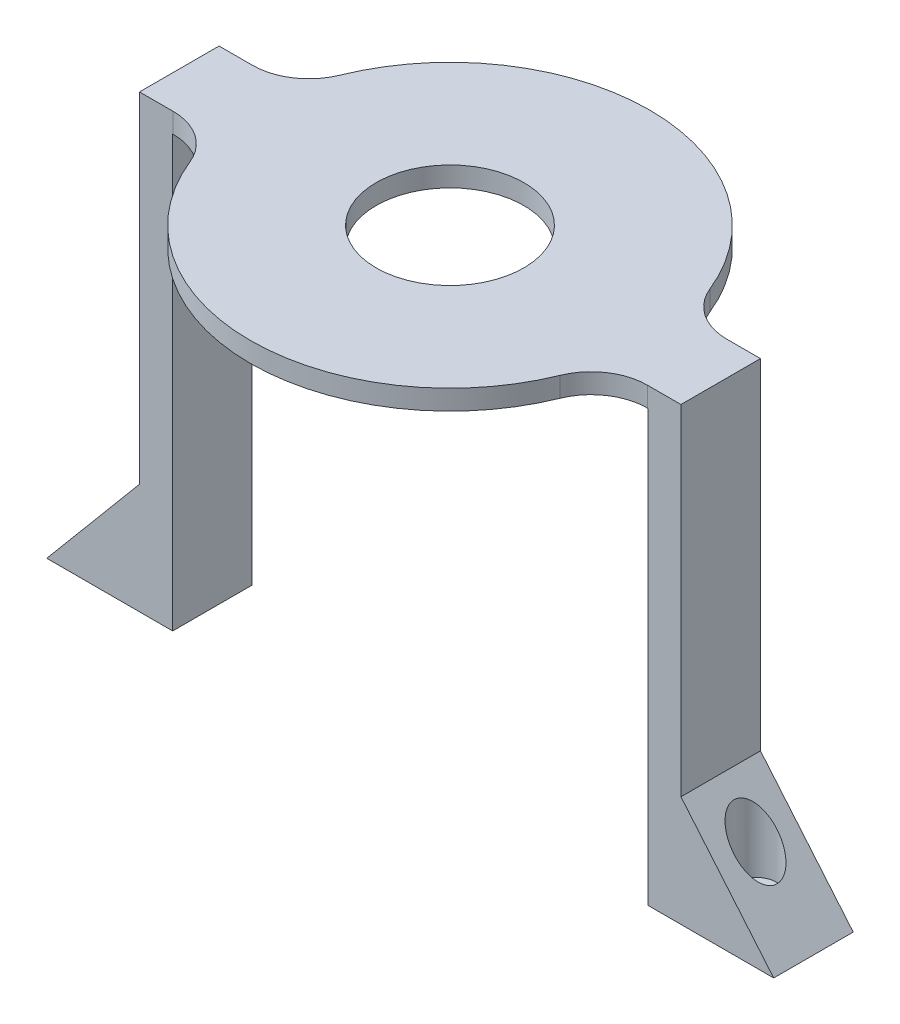
ISO-10303-21;
HEADER;
FILE_DESCRIPTION(('STEP AP214'),'2;1');
FILE_NAME('part.step','',(''),(''),'','','');
FILE_SCHEMA(('AUTOMOTIVE_DESIGN { 1 0 10303 214 1 1 1 1 }'));
ENDSEC;
DATA;
#1=APPLICATION_CONTEXT('core data for automotive mechanical design processes');
#2=APPLICATION_PROTOCOL_DEFINITION('international standard','automotive_design',2000,#1);
#3=PRODUCT_CONTEXT('',#1,'mechanical');
#4=PRODUCT('Part','Part','',(#3));
#5=PRODUCT_RELATED_PRODUCT_CATEGORY('part','',(#4));
#6=PRODUCT_DEFINITION_FORMATION('','',#4);
#7=PRODUCT_DEFINITION_CONTEXT('part definition',#1,'design');
#8=PRODUCT_DEFINITION('design','',#6,#7);
#9=PRODUCT_DEFINITION_SHAPE('','',#8);
#10=(LENGTH_UNIT() NAMED_UNIT(*) SI_UNIT(.MILLI.,.METRE.));
#11=(NAMED_UNIT(*) PLANE_ANGLE_UNIT() SI_UNIT($,.RADIAN.));
#12=(NAMED_UNIT(*) SI_UNIT($,.STERADIAN.) SOLID_ANGLE_UNIT());
#13=UNCERTAINTY_MEASURE_WITH_UNIT(LENGTH_MEASURE(1.E-05),#10,'distance_accuracy_value','');
#14=(GEOMETRIC_REPRESENTATION_CONTEXT(3) GLOBAL_UNCERTAINTY_ASSIGNED_CONTEXT((#13)) GLOBAL_UNIT_ASSIGNED_CONTEXT((#10,
#11,#12)) REPRESENTATION_CONTEXT('',''));
#15=CARTESIAN_POINT('',(0.,0.,0.));
#16=DIRECTION('',(0.,0.,1.));
#17=DIRECTION('',(1.,0.,0.));
#18=AXIS2_PLACEMENT_3D('',#15,#16,#17);
#19=CARTESIAN_POINT('',(0.,3.,0.));
#20=DIRECTION('',(0.,1.,0.));
#21=DIRECTION('',(0.,0.,1.));
#22=AXIS2_PLACEMENT_3D('',#19,#20,#21);
#23=PLANE('',#22);
#24=CARTESIAN_POINT('',(0.,3.,0.));
#25=DIRECTION('',(0.,1.,0.));
#26=DIRECTION('',(0.,0.,1.));
#27=AXIS2_PLACEMENT_3D('',#24,#25,#26);
#28=CIRCLE('',#27,30.125);
#29=CARTESIAN_POINT('',(27.9216896559898,3.,-11.3090614886731));
#30=VERTEX_POINT('',#29);
#31=CARTESIAN_POINT('',(-27.9216896559898,3.,-11.3090614886731));
#32=VERTEX_POINT('',#31);
#33=EDGE_CURVE('E300',#30,#32,#28,.T.);
#34=ORIENTED_EDGE('',*,*,#33,.T.);
#35=CARTESIAN_POINT('',(-35.8000087290492,3.,-14.5));
#36=DIRECTION('',(0.,1.,0.));
#37=DIRECTION('',(0.,0.,1.));
#38=AXIS2_PLACEMENT_3D('',#35,#36,#37);
#39=CIRCLE('',#38,8.5);
#40=CARTESIAN_POINT('',(-35.8000087290492,3.,-6.));
#41=VERTEX_POINT('',#40);
#42=EDGE_CURVE('E387',#32,#41,#39,.F.);
#43=ORIENTED_EDGE('',*,*,#42,.T.);
#44=DIRECTION('',(-1.,0.,0.));
#45=VECTOR('',#44,1.);
#46=CARTESIAN_POINT('',(-35.85,3.,-6.));
#47=LINE('',#46,#45);
#48=CARTESIAN_POINT('',(-40.85,3.,-6.00000000000001));
#49=VERTEX_POINT('',#48);
#50=EDGE_CURVE('E304',#41,#49,#47,.T.);
#51=ORIENTED_EDGE('',*,*,#50,.T.);
#52=DIRECTION('',(0.,0.,1.));
#53=VECTOR('',#52,1.);
#54=CARTESIAN_POINT('',(-40.85,3.,-76.5563781666831));
#55=LINE('',#54,#53);
#56=CARTESIAN_POINT('',(-40.85,3.,6.));
#57=VERTEX_POINT('',#56);
#58=EDGE_CURVE('E268',#49,#57,#55,.T.);
#59=ORIENTED_EDGE('',*,*,#58,.T.);
#60=DIRECTION('',(1.,0.,0.));
#61=VECTOR('',#60,1.);
#62=CARTESIAN_POINT('',(-35.85,3.,6.));
#63=LINE('',#62,#61);
#64=CARTESIAN_POINT('',(-35.8000087290492,3.,6.));
#65=VERTEX_POINT('',#64);
#66=EDGE_CURVE('E285',#57,#65,#63,.T.);
#67=ORIENTED_EDGE('',*,*,#66,.T.);
#68=CARTESIAN_POINT('',(-35.8000087290492,3.,14.5));
#69=DIRECTION('',(0.,1.,0.));
#70=DIRECTION('',(0.,0.,1.));
#71=AXIS2_PLACEMENT_3D('',#68,#69,#70);
#72=CIRCLE('',#71,8.5);
#73=CARTESIAN_POINT('',(-27.9216896559898,3.,11.3090614886731));
#74=VERTEX_POINT('',#73);
#75=EDGE_CURVE('E11',#65,#74,#72,.F.);
#76=ORIENTED_EDGE('',*,*,#75,.T.);
#77=CARTESIAN_POINT('',(0.,3.,0.));
#78=DIRECTION('',(0.,1.,0.));
#79=DIRECTION('',(0.,0.,1.));
#80=AXIS2_PLACEMENT_3D('',#77,#78,#79);
#81=CIRCLE('',#80,30.125);
#82=CARTESIAN_POINT('',(27.9216896559898,3.,11.3090614886731));
#83=VERTEX_POINT('',#82);
#84=EDGE_CURVE('E288',#74,#83,#81,.T.);
#85=ORIENTED_EDGE('',*,*,#84,.T.);
#86=CARTESIAN_POINT('',(35.8000087290492,3.,14.5));
#87=DIRECTION('',(0.,1.,0.));
#88=DIRECTION('',(0.,0.,1.));
#89=AXIS2_PLACEMENT_3D('',#86,#87,#88);
#90=CIRCLE('',#89,8.5);
#91=CARTESIAN_POINT('',(35.8000087290492,3.,6.));
#92=VERTEX_POINT('',#91);
#93=EDGE_CURVE('E381',#83,#92,#90,.F.);
#94=ORIENTED_EDGE('',*,*,#93,.T.);
#95=DIRECTION('',(1.,0.,0.));
#96=VECTOR('',#95,1.);
#97=CARTESIAN_POINT('',(29.5214434775808,3.,6.));
#98=LINE('',#97,#96);
#99=CARTESIAN_POINT('',(40.85,3.,6.));
#100=VERTEX_POINT('',#99);
#101=EDGE_CURVE('E293',#92,#100,#98,.T.);
#102=ORIENTED_EDGE('',*,*,#101,.T.);
#103=DIRECTION('',(0.,0.,1.));
#104=VECTOR('',#103,1.);
#105=CARTESIAN_POINT('',(40.85,3.,-76.5563781666831));
#106=LINE('',#105,#104);
#107=CARTESIAN_POINT('',(40.85,3.,-6.00000000000001));
#108=VERTEX_POINT('',#107);
#109=EDGE_CURVE('E215',#108,#100,#106,.T.);
#110=ORIENTED_EDGE('',*,*,#109,.F.);
#111=DIRECTION('',(-1.,0.,0.));
#112=VECTOR('',#111,1.);
#113=CARTESIAN_POINT('',(29.5214434775808,3.,-6.));
#114=LINE('',#113,#112);
#115=CARTESIAN_POINT('',(35.8000087290492,3.,-6.));
#116=VERTEX_POINT('',#115);
#117=EDGE_CURVE('E296',#108,#116,#114,.T.);
#118=ORIENTED_EDGE('',*,*,#117,.T.);
#119=CARTESIAN_POINT('',(35.8000087290492,3.,-14.5));
#120=DIRECTION('',(0.,1.,0.));
#121=DIRECTION('',(0.,0.,1.));
#122=AXIS2_PLACEMENT_3D('',#119,#120,#121);
#123=CIRCLE('',#122,8.5);
#124=EDGE_CURVE('E375',#116,#30,#123,.F.);
#125=ORIENTED_EDGE('',*,*,#124,.T.);
#126=EDGE_LOOP('',(#34,#43,#51,#59,#67,#76,#85,#94,#102,#110,#118,#125));
#127=FACE_BOUND('',#126,.T.);
#128=CARTESIAN_POINT('',(0.,3.,0.));
#129=DIRECTION('',(0.,1.,0.));
#130=DIRECTION('',(0.,0.,1.));
#131=AXIS2_PLACEMENT_3D('',#128,#129,#130);
#132=CIRCLE('',#131,11.15);
#133=CARTESIAN_POINT('',(0.,3.,11.15));
#134=VERTEX_POINT('',#133);
#135=EDGE_CURVE('E277',#134,#134,#132,.T.);
#136=ORIENTED_EDGE('',*,*,#135,.F.);
#137=EDGE_LOOP('',(#136));
#138=FACE_BOUND('',#137,.T.);
#139=ADVANCED_FACE('F44',(#127,#138),#23,.T.);
#140=CARTESIAN_POINT('',(0.,0.,0.));
#141=DIRECTION('',(0.,1.,0.));
#142=DIRECTION('',(0.,0.,1.));
#143=AXIS2_PLACEMENT_3D('',#140,#141,#142);
#144=PLANE('',#143);
#145=DIRECTION('',(0.,0.,1.));
#146=VECTOR('',#145,1.);
#147=CARTESIAN_POINT('',(-35.85,0.,-6.));
#148=LINE('',#147,#146);
#149=CARTESIAN_POINT('',(-35.85,0.,-6.));
#150=VERTEX_POINT('',#149);
#151=CARTESIAN_POINT('',(-35.85,0.,6.));
#152=VERTEX_POINT('',#151);
#153=EDGE_CURVE('E281',#150,#152,#148,.T.);
#154=ORIENTED_EDGE('',*,*,#153,.F.);
#155=DIRECTION('',(-1.,0.,0.));
#156=VECTOR('',#155,1.);
#157=CARTESIAN_POINT('',(-35.85,0.,-6.));
#158=LINE('',#157,#156);
#159=CARTESIAN_POINT('',(-35.8000087290492,0.,-6.));
#160=VERTEX_POINT('',#159);
#161=EDGE_CURVE('E289',#160,#150,#158,.T.);
#162=ORIENTED_EDGE('',*,*,#161,.F.);
#163=CARTESIAN_POINT('',(-35.8000087290492,0.,-14.5));
#164=DIRECTION('',(0.,1.,0.));
#165=DIRECTION('',(0.,0.,1.));
#166=AXIS2_PLACEMENT_3D('',#163,#164,#165);
#167=CIRCLE('',#166,8.5);
#168=CARTESIAN_POINT('',(-27.9216896559898,0.,-11.3090614886731));
#169=VERTEX_POINT('',#168);
#170=EDGE_CURVE('E384',#160,#169,#167,.T.);
#171=ORIENTED_EDGE('',*,*,#170,.T.);
#172=CARTESIAN_POINT('',(0.,0.,0.));
#173=DIRECTION('',(0.,1.,0.));
#174=DIRECTION('',(0.,0.,1.));
#175=AXIS2_PLACEMENT_3D('',#172,#173,#174);
#176=CIRCLE('',#175,30.125);
#177=CARTESIAN_POINT('',(27.9216896559898,0.,-11.3090614886731));
#178=VERTEX_POINT('',#177);
#179=EDGE_CURVE('E329',#178,#169,#176,.T.);
#180=ORIENTED_EDGE('',*,*,#179,.F.);
#181=CARTESIAN_POINT('',(35.8000087290492,0.,-14.5));
#182=DIRECTION('',(0.,1.,0.));
#183=DIRECTION('',(0.,0.,1.));
#184=AXIS2_PLACEMENT_3D('',#181,#182,#183);
#185=CIRCLE('',#184,8.5);
#186=CARTESIAN_POINT('',(35.8000087290492,0.,-6.));
#187=VERTEX_POINT('',#186);
#188=EDGE_CURVE('E372',#178,#187,#185,.T.);
#189=ORIENTED_EDGE('',*,*,#188,.T.);
#190=DIRECTION('',(-1.,0.,0.));
#191=VECTOR('',#190,1.);
#192=CARTESIAN_POINT('',(29.5214434775808,0.,-6.));
#193=LINE('',#192,#191);
#194=CARTESIAN_POINT('',(35.85,0.,-6.00000000000001));
#195=VERTEX_POINT('',#194);
#196=EDGE_CURVE('E325',#195,#187,#193,.T.);
#197=ORIENTED_EDGE('',*,*,#196,.F.);
#198=DIRECTION('',(0.,0.,-1.));
#199=VECTOR('',#198,1.);
#200=CARTESIAN_POINT('',(35.85,0.,-6.));
#201=LINE('',#200,#199);
#202=CARTESIAN_POINT('',(35.85,0.,6.));
#203=VERTEX_POINT('',#202);
#204=EDGE_CURVE('E321',#203,#195,#201,.T.);
#205=ORIENTED_EDGE('',*,*,#204,.F.);
#206=DIRECTION('',(1.,0.,0.));
#207=VECTOR('',#206,1.);
#208=CARTESIAN_POINT('',(29.5214434775808,0.,6.));
#209=LINE('',#208,#207);
#210=CARTESIAN_POINT('',(35.8000087290492,0.,6.));
#211=VERTEX_POINT('',#210);
#212=EDGE_CURVE('E318',#211,#203,#209,.T.);
#213=ORIENTED_EDGE('',*,*,#212,.F.);
#214=CARTESIAN_POINT('',(35.8000087290492,0.,14.5));
#215=DIRECTION('',(0.,1.,0.));
#216=DIRECTION('',(0.,0.,1.));
#217=AXIS2_PLACEMENT_3D('',#214,#215,#216);
#218=CIRCLE('',#217,8.5);
#219=CARTESIAN_POINT('',(27.9216896559898,0.,11.3090614886731));
#220=VERTEX_POINT('',#219);
#221=EDGE_CURVE('E378',#211,#220,#218,.T.);
#222=ORIENTED_EDGE('',*,*,#221,.T.);
#223=CARTESIAN_POINT('',(0.,0.,0.));
#224=DIRECTION('',(0.,1.,0.));
#225=DIRECTION('',(0.,0.,1.));
#226=AXIS2_PLACEMENT_3D('',#223,#224,#225);
#227=CIRCLE('',#226,30.125);
#228=CARTESIAN_POINT('',(-27.9216896559898,0.,11.3090614886731));
#229=VERTEX_POINT('',#228);
#230=EDGE_CURVE('E314',#229,#220,#227,.T.);
#231=ORIENTED_EDGE('',*,*,#230,.F.);
#232=CARTESIAN_POINT('',(-35.8000087290492,0.,14.5));
#233=DIRECTION('',(0.,1.,0.));
#234=DIRECTION('',(0.,0.,1.));
#235=AXIS2_PLACEMENT_3D('',#232,#233,#234);
#236=CIRCLE('',#235,8.5);
#237=CARTESIAN_POINT('',(-35.8000087290492,0.,6.));
#238=VERTEX_POINT('',#237);
#239=EDGE_CURVE('E53',#229,#238,#236,.T.);
#240=ORIENTED_EDGE('',*,*,#239,.T.);
#241=DIRECTION('',(1.,0.,0.));
#242=VECTOR('',#241,1.);
#243=CARTESIAN_POINT('',(-35.85,0.,6.));
#244=LINE('',#243,#242);
#245=EDGE_CURVE('E311',#152,#238,#244,.T.);
#246=ORIENTED_EDGE('',*,*,#245,.F.);
#247=EDGE_LOOP('',(#154,#162,#171,#180,#189,#197,#205,#213,#222,#231,#240,#246));
#248=FACE_BOUND('',#247,.T.);
#249=CARTESIAN_POINT('',(0.,0.,0.));
#250=DIRECTION('',(0.,1.,0.));
#251=DIRECTION('',(0.,0.,1.));
#252=AXIS2_PLACEMENT_3D('',#249,#250,#251);
#253=CIRCLE('',#252,11.15);
#254=CARTESIAN_POINT('',(0.,0.,11.15));
#255=VERTEX_POINT('',#254);
#256=EDGE_CURVE('E276',#255,#255,#253,.T.);
#257=ORIENTED_EDGE('',*,*,#256,.T.);
#258=EDGE_LOOP('',(#257));
#259=FACE_BOUND('',#258,.T.);
#260=ADVANCED_FACE('F422',(#248,#259),#144,.F.);
#261=CARTESIAN_POINT('',(-35.85,3.,6.));
#262=DIRECTION('',(0.,0.,-1.));
#263=DIRECTION('',(-1.,0.,0.));
#264=AXIS2_PLACEMENT_3D('',#261,#262,#263);
#265=PLANE('',#264);
#266=ORIENTED_EDGE('',*,*,#245,.T.);
#267=DIRECTION('',(0.,1.,0.));
#268=VECTOR('',#267,1.);
#269=CARTESIAN_POINT('',(-35.8000087290492,3.,6.));
#270=LINE('',#269,#268);
#271=EDGE_CURVE('E60',#238,#65,#270,.T.);
#272=ORIENTED_EDGE('',*,*,#271,.T.);
#273=ORIENTED_EDGE('',*,*,#66,.F.);
#274=DIRECTION('',(0.,-1.,0.));
#275=VECTOR('',#274,1.);
#276=CARTESIAN_POINT('',(-40.85,-48.2654497036811,6.));
#277=LINE('',#276,#275);
#278=CARTESIAN_POINT('',(-40.85,-48.2654497036811,6.));
#279=VERTEX_POINT('',#278);
#280=EDGE_CURVE('E254',#57,#279,#277,.T.);
#281=ORIENTED_EDGE('',*,*,#280,.T.);
#282=DIRECTION('',(-0.642787609686541,-0.766044443118977,0.));
#283=VECTOR('',#282,1.);
#284=CARTESIAN_POINT('',(-54.85,-64.95,6.));
#285=LINE('',#284,#283);
#286=CARTESIAN_POINT('',(-54.85,-64.95,6.));
#287=VERTEX_POINT('',#286);
#288=EDGE_CURVE('E258',#279,#287,#285,.T.);
#289=ORIENTED_EDGE('',*,*,#288,.T.);
#290=DIRECTION('',(1.,0.,0.));
#291=VECTOR('',#290,1.);
#292=CARTESIAN_POINT('',(-35.85,-64.95,6.));
#293=LINE('',#292,#291);
#294=CARTESIAN_POINT('',(-35.85,-64.95,6.));
#295=VERTEX_POINT('',#294);
#296=EDGE_CURVE('E246',#287,#295,#293,.T.);
#297=ORIENTED_EDGE('',*,*,#296,.T.);
#298=DIRECTION('',(0.,1.,0.));
#299=VECTOR('',#298,1.);
#300=CARTESIAN_POINT('',(-35.85,3.,6.));
#301=LINE('',#300,#299);
#302=EDGE_CURVE('E250',#295,#152,#301,.T.);
#303=ORIENTED_EDGE('',*,*,#302,.T.);
#304=EDGE_LOOP('',(#266,#272,#273,#281,#289,#297,#303));
#305=FACE_BOUND('',#304,.T.);
#306=ADVANCED_FACE('F429',(#305),#265,.F.);
#307=CARTESIAN_POINT('',(0.,3.,0.));
#308=DIRECTION('',(0.,-1.,0.));
#309=DIRECTION('',(0.,0.,-1.));
#310=AXIS2_PLACEMENT_3D('',#307,#308,#309);
#311=CYLINDRICAL_SURFACE('',#310,30.125);
#312=ORIENTED_EDGE('',*,*,#230,.T.);
#313=DIRECTION('',(0.,-1.,0.));
#314=VECTOR('',#313,1.);
#315=CARTESIAN_POINT('',(27.9216896559898,3.,11.3090614886731));
#316=LINE('',#315,#314);
#317=EDGE_CURVE('E363',#220,#83,#316,.F.);
#318=ORIENTED_EDGE('',*,*,#317,.T.);
#319=ORIENTED_EDGE('',*,*,#84,.F.);
#320=DIRECTION('',(0.,-1.,0.));
#321=VECTOR('',#320,1.);
#322=CARTESIAN_POINT('',(-27.9216896559898,3.,11.3090614886731));
#323=LINE('',#322,#321);
#324=EDGE_CURVE('E359',#74,#229,#323,.T.);
#325=ORIENTED_EDGE('',*,*,#324,.T.);
#326=EDGE_LOOP('',(#312,#318,#319,#325));
#327=FACE_BOUND('',#326,.T.);
#328=ADVANCED_FACE('F450',(#327),#311,.T.);
#329=CARTESIAN_POINT('',(29.5214434775808,3.,6.));
#330=DIRECTION('',(0.,0.,-1.));
#331=DIRECTION('',(-1.,0.,0.));
#332=AXIS2_PLACEMENT_3D('',#329,#330,#331);
#333=PLANE('',#332);
#334=ORIENTED_EDGE('',*,*,#101,.F.);
#335=DIRECTION('',(0.,1.,0.));
#336=VECTOR('',#335,1.);
#337=CARTESIAN_POINT('',(35.8000087290492,0.,6.));
#338=LINE('',#337,#336);
#339=EDGE_CURVE('E355',#92,#211,#338,.F.);
#340=ORIENTED_EDGE('',*,*,#339,.T.);
#341=ORIENTED_EDGE('',*,*,#212,.T.);
#342=DIRECTION('',(0.,1.,0.));
#343=VECTOR('',#342,1.);
#344=CARTESIAN_POINT('',(35.85,3.,6.));
#345=LINE('',#344,#343);
#346=CARTESIAN_POINT('',(35.85,-64.95,6.));
#347=VERTEX_POINT('',#346);
#348=EDGE_CURVE('E181',#347,#203,#345,.T.);
#349=ORIENTED_EDGE('',*,*,#348,.F.);
#350=DIRECTION('',(-1.,0.,0.));
#351=VECTOR('',#350,1.);
#352=CARTESIAN_POINT('',(35.85,-64.95,6.));
#353=LINE('',#352,#351);
#354=CARTESIAN_POINT('',(54.85,-64.95,6.));
#355=VERTEX_POINT('',#354);
#356=EDGE_CURVE('E174',#355,#347,#353,.T.);
#357=ORIENTED_EDGE('',*,*,#356,.F.);
#358=DIRECTION('',(0.642787609686541,-0.766044443118977,0.));
#359=VECTOR('',#358,1.);
#360=CARTESIAN_POINT('',(54.85,-64.95,6.));
#361=LINE('',#360,#359);
#362=CARTESIAN_POINT('',(40.85,-48.2654497036811,6.));
#363=VERTEX_POINT('',#362);
#364=EDGE_CURVE('E184',#363,#355,#361,.T.);
#365=ORIENTED_EDGE('',*,*,#364,.F.);
#366=DIRECTION('',(0.,-1.,0.));
#367=VECTOR('',#366,1.);
#368=CARTESIAN_POINT('',(40.85,-48.2654497036811,6.));
#369=LINE('',#368,#367);
#370=EDGE_CURVE('E191',#100,#363,#369,.T.);
#371=ORIENTED_EDGE('',*,*,#370,.F.);
#372=EDGE_LOOP('',(#334,#340,#341,#349,#357,#365,#371));
#373=FACE_BOUND('',#372,.T.);
#374=ADVANCED_FACE('F195',(#373),#333,.F.);
#375=CARTESIAN_POINT('',(29.5214434775808,3.,-6.));
#376=DIRECTION('',(0.,0.,1.));
#377=DIRECTION('',(1.,0.,0.));
#378=AXIS2_PLACEMENT_3D('',#375,#376,#377);
#379=PLANE('',#378);
#380=ORIENTED_EDGE('',*,*,#196,.T.);
#381=DIRECTION('',(0.,1.,0.));
#382=VECTOR('',#381,1.);
#383=CARTESIAN_POINT('',(35.8000087290492,3.,-6.));
#384=LINE('',#383,#382);
#385=EDGE_CURVE('E352',#187,#116,#384,.T.);
#386=ORIENTED_EDGE('',*,*,#385,.T.);
#387=ORIENTED_EDGE('',*,*,#117,.F.);
#388=DIRECTION('',(0.,1.,0.));
#389=VECTOR('',#388,1.);
#390=CARTESIAN_POINT('',(40.85,-48.2654497036811,-6.00000000000001));
#391=LINE('',#390,#389);
#392=CARTESIAN_POINT('',(40.85,-48.2654497036811,-6.00000000000001));
#393=VERTEX_POINT('',#392);
#394=EDGE_CURVE('E223',#393,#108,#391,.T.);
#395=ORIENTED_EDGE('',*,*,#394,.F.);
#396=DIRECTION('',(-0.642787609686541,0.766044443118977,0.));
#397=VECTOR('',#396,1.);
#398=CARTESIAN_POINT('',(54.85,-64.95,-6.00000000000001));
#399=LINE('',#398,#397);
#400=CARTESIAN_POINT('',(54.85,-64.95,-6.00000000000001));
#401=VERTEX_POINT('',#400);
#402=EDGE_CURVE('E214',#401,#393,#399,.T.);
#403=ORIENTED_EDGE('',*,*,#402,.F.);
#404=DIRECTION('',(1.,0.,0.));
#405=VECTOR('',#404,1.);
#406=CARTESIAN_POINT('',(35.85,-64.95,-6.00000000000001));
#407=LINE('',#406,#405);
#408=CARTESIAN_POINT('',(35.85,-64.95,-6.00000000000001));
#409=VERTEX_POINT('',#408);
#410=EDGE_CURVE('E176',#409,#401,#407,.T.);
#411=ORIENTED_EDGE('',*,*,#410,.F.);
#412=DIRECTION('',(0.,-1.,0.));
#413=VECTOR('',#412,1.);
#414=CARTESIAN_POINT('',(35.85,3.,-6.00000000000001));
#415=LINE('',#414,#413);
#416=EDGE_CURVE('E392',#195,#409,#415,.T.);
#417=ORIENTED_EDGE('',*,*,#416,.F.);
#418=EDGE_LOOP('',(#380,#386,#387,#395,#403,#411,#417));
#419=FACE_BOUND('',#418,.T.);
#420=ADVANCED_FACE('F443',(#419),#379,.F.);
#421=CARTESIAN_POINT('',(0.,3.,0.));
#422=DIRECTION('',(0.,-1.,0.));
#423=DIRECTION('',(0.,0.,-1.));
#424=AXIS2_PLACEMENT_3D('',#421,#422,#423);
#425=CYLINDRICAL_SURFACE('',#424,30.125);
#426=ORIENTED_EDGE('',*,*,#33,.F.);
#427=DIRECTION('',(0.,-1.,0.));
#428=VECTOR('',#427,1.);
#429=CARTESIAN_POINT('',(27.9216896559898,3.,-11.3090614886731));
#430=LINE('',#429,#428);
#431=EDGE_CURVE('E348',#30,#178,#430,.T.);
#432=ORIENTED_EDGE('',*,*,#431,.T.);
#433=ORIENTED_EDGE('',*,*,#179,.T.);
#434=DIRECTION('',(0.,-1.,0.));
#435=VECTOR('',#434,1.);
#436=CARTESIAN_POINT('',(-27.9216896559898,3.,-11.3090614886731));
#437=LINE('',#436,#435);
#438=EDGE_CURVE('E307',#169,#32,#437,.F.);
#439=ORIENTED_EDGE('',*,*,#438,.T.);
#440=EDGE_LOOP('',(#426,#432,#433,#439));
#441=FACE_BOUND('',#440,.T.);
#442=ADVANCED_FACE('F439',(#441),#425,.T.);
#443=CARTESIAN_POINT('',(-35.85,3.,-6.));
#444=DIRECTION('',(0.,0.,1.));
#445=DIRECTION('',(1.,0.,0.));
#446=AXIS2_PLACEMENT_3D('',#443,#444,#445);
#447=PLANE('',#446);
#448=ORIENTED_EDGE('',*,*,#50,.F.);
#449=DIRECTION('',(0.,1.,0.));
#450=VECTOR('',#449,1.);
#451=CARTESIAN_POINT('',(-35.8000087290492,0.,-6.));
#452=LINE('',#451,#450);
#453=EDGE_CURVE('E366',#41,#160,#452,.F.);
#454=ORIENTED_EDGE('',*,*,#453,.T.);
#455=ORIENTED_EDGE('',*,*,#161,.T.);
#456=DIRECTION('',(0.,-1.,0.));
#457=VECTOR('',#456,1.);
#458=CARTESIAN_POINT('',(-35.85,3.,-6.00000000000001));
#459=LINE('',#458,#457);
#460=CARTESIAN_POINT('',(-35.85,-64.95,-6.00000000000001));
#461=VERTEX_POINT('',#460);
#462=EDGE_CURVE('E245',#150,#461,#459,.T.);
#463=ORIENTED_EDGE('',*,*,#462,.T.);
#464=DIRECTION('',(-1.,0.,0.));
#465=VECTOR('',#464,1.);
#466=CARTESIAN_POINT('',(-35.85,-64.95,-6.00000000000001));
#467=LINE('',#466,#465);
#468=CARTESIAN_POINT('',(-54.85,-64.95,-6.00000000000001));
#469=VERTEX_POINT('',#468);
#470=EDGE_CURVE('E242',#461,#469,#467,.T.);
#471=ORIENTED_EDGE('',*,*,#470,.T.);
#472=DIRECTION('',(0.642787609686541,0.766044443118977,0.));
#473=VECTOR('',#472,1.);
#474=CARTESIAN_POINT('',(-54.85,-64.95,-6.00000000000001));
#475=LINE('',#474,#473);
#476=CARTESIAN_POINT('',(-40.85,-48.2654497036811,-6.00000000000001));
#477=VERTEX_POINT('',#476);
#478=EDGE_CURVE('E238',#469,#477,#475,.T.);
#479=ORIENTED_EDGE('',*,*,#478,.T.);
#480=DIRECTION('',(0.,1.,0.));
#481=VECTOR('',#480,1.);
#482=CARTESIAN_POINT('',(-40.85,-48.2654497036811,-6.00000000000001));
#483=LINE('',#482,#481);
#484=EDGE_CURVE('E234',#477,#49,#483,.T.);
#485=ORIENTED_EDGE('',*,*,#484,.T.);
#486=EDGE_LOOP('',(#448,#454,#455,#463,#471,#479,#485));
#487=FACE_BOUND('',#486,.T.);
#488=ADVANCED_FACE('F436',(#487),#447,.F.);
#489=CARTESIAN_POINT('',(0.,3.,0.));
#490=DIRECTION('',(0.,-1.,0.));
#491=DIRECTION('',(0.,0.,-1.));
#492=AXIS2_PLACEMENT_3D('',#489,#490,#491);
#493=CYLINDRICAL_SURFACE('',#492,11.15);
#494=ORIENTED_EDGE('',*,*,#135,.T.);
#495=EDGE_LOOP('',(#494));
#496=FACE_BOUND('',#495,.T.);
#497=ORIENTED_EDGE('',*,*,#256,.F.);
#498=EDGE_LOOP('',(#497));
#499=FACE_BOUND('',#498,.T.);
#500=ADVANCED_FACE('F433',(#496,#499),#493,.F.);
#501=CARTESIAN_POINT('',(-35.85,-64.95,-76.5563781666831));
#502=DIRECTION('',(0.,-1.,0.));
#503=DIRECTION('',(0.,0.,-1.));
#504=AXIS2_PLACEMENT_3D('',#501,#502,#503);
#505=PLANE('',#504);
#506=CARTESIAN_POINT('',(-46.1,-64.95,0.));
#507=DIRECTION('',(0.,1.,0.));
#508=DIRECTION('',(0.,0.,1.));
#509=AXIS2_PLACEMENT_3D('',#506,#507,#508);
#510=CIRCLE('',#509,1.7);
#511=CARTESIAN_POINT('',(-46.1,-64.95,1.7));
#512=VERTEX_POINT('',#511);
#513=EDGE_CURVE('E224',#512,#512,#510,.T.);
#514=ORIENTED_EDGE('',*,*,#513,.T.);
#515=EDGE_LOOP('',(#514));
#516=FACE_BOUND('',#515,.T.);
#517=ORIENTED_EDGE('',*,*,#470,.F.);
#518=DIRECTION('',(0.,0.,1.));
#519=VECTOR('',#518,1.);
#520=CARTESIAN_POINT('',(-35.85,-64.95,-76.5563781666831));
#521=LINE('',#520,#519);
#522=EDGE_CURVE('E262',#461,#295,#521,.T.);
#523=ORIENTED_EDGE('',*,*,#522,.T.);
#524=ORIENTED_EDGE('',*,*,#296,.F.);
#525=DIRECTION('',(0.,0.,1.));
#526=VECTOR('',#525,1.);
#527=CARTESIAN_POINT('',(-54.85,-64.95,-76.5563781666831));
#528=LINE('',#527,#526);
#529=EDGE_CURVE('E239',#469,#287,#528,.T.);
#530=ORIENTED_EDGE('',*,*,#529,.F.);
#531=EDGE_LOOP('',(#517,#523,#524,#530));
#532=FACE_BOUND('',#531,.T.);
#533=ADVANCED_FACE('F505',(#516,#532),#505,.T.);
#534=CARTESIAN_POINT('',(-54.85,-64.95,-76.5563781666831));
#535=DIRECTION('',(-0.766044443118977,0.642787609686541,0.));
#536=DIRECTION('',(-0.642787609686541,-0.766044443118977,0.));
#537=AXIS2_PLACEMENT_3D('',#534,#535,#536);
#538=PLANE('',#537);
#539=CARTESIAN_POINT('',(-46.1,-54.5221560648007,0.));
#540=DIRECTION('',(-0.766044443118977,0.642787609686541,0.));
#541=DIRECTION('',(0.642787609686541,0.766044443118977,0.));
#542=AXIS2_PLACEMENT_3D('',#539,#540,#541);
#543=ELLIPSE('',#542,5.05610243729633,3.25);
#544=CARTESIAN_POINT('',(-42.85,-50.6489568888696,0.));
#545=VERTEX_POINT('',#544);
#546=EDGE_CURVE('E233',#545,#545,#543,.T.);
#547=ORIENTED_EDGE('',*,*,#546,.F.);
#548=EDGE_LOOP('',(#547));
#549=FACE_BOUND('',#548,.T.);
#550=ORIENTED_EDGE('',*,*,#478,.F.);
#551=ORIENTED_EDGE('',*,*,#529,.T.);
#552=ORIENTED_EDGE('',*,*,#288,.F.);
#553=DIRECTION('',(0.,0.,1.));
#554=VECTOR('',#553,1.);
#555=CARTESIAN_POINT('',(-40.85,-48.2654497036811,-76.5563781666831));
#556=LINE('',#555,#554);
#557=EDGE_CURVE('E265',#477,#279,#556,.T.);
#558=ORIENTED_EDGE('',*,*,#557,.F.);
#559=EDGE_LOOP('',(#550,#551,#552,#558));
#560=FACE_BOUND('',#559,.T.);
#561=ADVANCED_FACE('F511',(#549,#560),#538,.T.);
#562=CARTESIAN_POINT('',(-40.85,-48.2654497036811,-76.5563781666831));
#563=DIRECTION('',(-1.,0.,0.));
#564=DIRECTION('',(0.,-1.,0.));
#565=AXIS2_PLACEMENT_3D('',#562,#563,#564);
#566=PLANE('',#565);
#567=ORIENTED_EDGE('',*,*,#484,.F.);
#568=ORIENTED_EDGE('',*,*,#557,.T.);
#569=ORIENTED_EDGE('',*,*,#280,.F.);
#570=ORIENTED_EDGE('',*,*,#58,.F.);
#571=EDGE_LOOP('',(#567,#568,#569,#570));
#572=FACE_BOUND('',#571,.T.);
#573=ADVANCED_FACE('F482',(#572),#566,.T.);
#574=CARTESIAN_POINT('',(-35.85,3.,-76.5563781666831));
#575=DIRECTION('',(1.,0.,0.));
#576=DIRECTION('',(0.,1.,0.));
#577=AXIS2_PLACEMENT_3D('',#574,#575,#576);
#578=PLANE('',#577);
#579=ORIENTED_EDGE('',*,*,#462,.F.);
#580=ORIENTED_EDGE('',*,*,#153,.T.);
#581=ORIENTED_EDGE('',*,*,#302,.F.);
#582=ORIENTED_EDGE('',*,*,#522,.F.);
#583=EDGE_LOOP('',(#579,#580,#581,#582));
#584=FACE_BOUND('',#583,.T.);
#585=ADVANCED_FACE('F508',(#584),#578,.T.);
#586=CARTESIAN_POINT('',(-46.1,-61.4654497036811,0.));
#587=DIRECTION('',(0.,1.,0.));
#588=DIRECTION('',(0.,0.,1.));
#589=AXIS2_PLACEMENT_3D('',#586,#587,#588);
#590=CYLINDRICAL_SURFACE('',#589,3.25);
#591=ORIENTED_EDGE('',*,*,#546,.T.);
#592=EDGE_LOOP('',(#591));
#593=FACE_BOUND('',#592,.T.);
#594=CARTESIAN_POINT('',(-46.1,-61.4654497036811,0.));
#595=DIRECTION('',(0.,1.,0.));
#596=DIRECTION('',(0.,0.,1.));
#597=AXIS2_PLACEMENT_3D('',#594,#595,#596);
#598=CIRCLE('',#597,3.25);
#599=CARTESIAN_POINT('',(-46.1,-61.4654497036811,3.25));
#600=VERTEX_POINT('',#599);
#601=EDGE_CURVE('E229',#600,#600,#598,.T.);
#602=ORIENTED_EDGE('',*,*,#601,.F.);
#603=EDGE_LOOP('',(#602));
#604=FACE_BOUND('',#603,.T.);
#605=ADVANCED_FACE('F525',(#593,#604),#590,.F.);
#606=CARTESIAN_POINT('',(-46.1,-61.4654497036811,0.));
#607=DIRECTION('',(0.,1.,0.));
#608=DIRECTION('',(0.,0.,1.));
#609=AXIS2_PLACEMENT_3D('',#606,#607,#608);
#610=PLANE('',#609);
#611=CARTESIAN_POINT('',(-46.1,-61.4654497036811,0.));
#612=DIRECTION('',(0.,1.,0.));
#613=DIRECTION('',(0.,0.,1.));
#614=AXIS2_PLACEMENT_3D('',#611,#612,#613);
#615=CIRCLE('',#614,1.7);
#616=CARTESIAN_POINT('',(-46.1,-61.4654497036811,1.7));
#617=VERTEX_POINT('',#616);
#618=EDGE_CURVE('E228',#617,#617,#615,.T.);
#619=ORIENTED_EDGE('',*,*,#618,.F.);
#620=EDGE_LOOP('',(#619));
#621=FACE_BOUND('',#620,.T.);
#622=ORIENTED_EDGE('',*,*,#601,.T.);
#623=EDGE_LOOP('',(#622));
#624=FACE_BOUND('',#623,.T.);
#625=ADVANCED_FACE('F530',(#621,#624),#610,.T.);
#626=CARTESIAN_POINT('',(-46.1,-64.95,0.));
#627=DIRECTION('',(0.,1.,0.));
#628=DIRECTION('',(0.,0.,1.));
#629=AXIS2_PLACEMENT_3D('',#626,#627,#628);
#630=CYLINDRICAL_SURFACE('',#629,1.7);
#631=ORIENTED_EDGE('',*,*,#618,.T.);
#632=EDGE_LOOP('',(#631));
#633=FACE_BOUND('',#632,.T.);
#634=ORIENTED_EDGE('',*,*,#513,.F.);
#635=EDGE_LOOP('',(#634));
#636=FACE_BOUND('',#635,.T.);
#637=ADVANCED_FACE('F535',(#633,#636),#630,.F.);
#638=CARTESIAN_POINT('',(35.85,3.,-76.5563781666831));
#639=DIRECTION('',(1.,0.,0.));
#640=DIRECTION('',(0.,1.,0.));
#641=AXIS2_PLACEMENT_3D('',#638,#639,#640);
#642=PLANE('',#641);
#643=ORIENTED_EDGE('',*,*,#348,.T.);
#644=ORIENTED_EDGE('',*,*,#204,.T.);
#645=ORIENTED_EDGE('',*,*,#416,.T.);
#646=DIRECTION('',(0.,0.,1.));
#647=VECTOR('',#646,1.);
#648=CARTESIAN_POINT('',(35.85,-64.95,-76.5563781666831));
#649=LINE('',#648,#647);
#650=EDGE_CURVE('E211',#409,#347,#649,.T.);
#651=ORIENTED_EDGE('',*,*,#650,.T.);
#652=EDGE_LOOP('',(#643,#644,#645,#651));
#653=FACE_BOUND('',#652,.T.);
#654=ADVANCED_FACE('F543',(#653),#642,.F.);
#655=CARTESIAN_POINT('',(54.85,-64.95,-76.5563781666831));
#656=DIRECTION('',(-0.766044443118977,-0.642787609686541,0.));
#657=DIRECTION('',(0.642787609686541,-0.766044443118977,0.));
#658=AXIS2_PLACEMENT_3D('',#655,#656,#657);
#659=PLANE('',#658);
#660=CARTESIAN_POINT('',(46.1,-54.5221560648007,0.));
#661=DIRECTION('',(-0.766044443118977,-0.642787609686541,0.));
#662=DIRECTION('',(-0.642787609686541,0.766044443118977,0.));
#663=AXIS2_PLACEMENT_3D('',#660,#661,#662);
#664=ELLIPSE('',#663,5.05610243729633,3.25);
#665=CARTESIAN_POINT('',(42.85,-50.6489568888696,0.));
#666=VERTEX_POINT('',#665);
#667=EDGE_CURVE('E198',#666,#666,#664,.F.);
#668=ORIENTED_EDGE('',*,*,#667,.F.);
#669=EDGE_LOOP('',(#668));
#670=FACE_BOUND('',#669,.T.);
#671=DIRECTION('',(0.,0.,1.));
#672=VECTOR('',#671,1.);
#673=CARTESIAN_POINT('',(54.85,-64.95,-76.5563781666831));
#674=LINE('',#673,#672);
#675=EDGE_CURVE('E169',#401,#355,#674,.T.);
#676=ORIENTED_EDGE('',*,*,#675,.F.);
#677=ORIENTED_EDGE('',*,*,#402,.T.);
#678=DIRECTION('',(0.,0.,1.));
#679=VECTOR('',#678,1.);
#680=CARTESIAN_POINT('',(40.85,-48.2654497036811,-76.5563781666831));
#681=LINE('',#680,#679);
#682=EDGE_CURVE('E180',#393,#363,#681,.T.);
#683=ORIENTED_EDGE('',*,*,#682,.T.);
#684=ORIENTED_EDGE('',*,*,#364,.T.);
#685=EDGE_LOOP('',(#676,#677,#683,#684));
#686=FACE_BOUND('',#685,.T.);
#687=ADVANCED_FACE('F185',(#670,#686),#659,.F.);
#688=CARTESIAN_POINT('',(40.85,-48.2654497036811,-76.5563781666831));
#689=DIRECTION('',(-1.,0.,0.));
#690=DIRECTION('',(0.,-1.,0.));
#691=AXIS2_PLACEMENT_3D('',#688,#689,#690);
#692=PLANE('',#691);
#693=ORIENTED_EDGE('',*,*,#682,.F.);
#694=ORIENTED_EDGE('',*,*,#394,.T.);
#695=ORIENTED_EDGE('',*,*,#109,.T.);
#696=ORIENTED_EDGE('',*,*,#370,.T.);
#697=EDGE_LOOP('',(#693,#694,#695,#696));
#698=FACE_BOUND('',#697,.T.);
#699=ADVANCED_FACE('F409',(#698),#692,.F.);
#700=CARTESIAN_POINT('',(35.85,-64.95,-76.5563781666831));
#701=DIRECTION('',(0.,1.,0.));
#702=DIRECTION('',(0.,0.,1.));
#703=AXIS2_PLACEMENT_3D('',#700,#701,#702);
#704=PLANE('',#703);
#705=CARTESIAN_POINT('',(46.1,-64.95,0.));
#706=DIRECTION('',(0.,-1.,0.));
#707=DIRECTION('',(0.,0.,1.));
#708=AXIS2_PLACEMENT_3D('',#705,#706,#707);
#709=CIRCLE('',#708,1.7);
#710=CARTESIAN_POINT('',(46.1,-64.95,1.7));
#711=VERTEX_POINT('',#710);
#712=EDGE_CURVE('E345',#711,#711,#709,.T.);
#713=ORIENTED_EDGE('',*,*,#712,.F.);
#714=EDGE_LOOP('',(#713));
#715=FACE_BOUND('',#714,.T.);
#716=ORIENTED_EDGE('',*,*,#650,.F.);
#717=ORIENTED_EDGE('',*,*,#410,.T.);
#718=ORIENTED_EDGE('',*,*,#675,.T.);
#719=ORIENTED_EDGE('',*,*,#356,.T.);
#720=EDGE_LOOP('',(#716,#717,#718,#719));
#721=FACE_BOUND('',#720,.T.);
#722=ADVANCED_FACE('F172',(#715,#721),#704,.F.);
#723=CARTESIAN_POINT('',(46.1,-61.4654497036811,0.));
#724=DIRECTION('',(0.,1.,0.));
#725=DIRECTION('',(0.,0.,1.));
#726=AXIS2_PLACEMENT_3D('',#723,#724,#725);
#727=CYLINDRICAL_SURFACE('',#726,3.25);
#728=CARTESIAN_POINT('',(46.1,-61.4654497036811,0.));
#729=DIRECTION('',(0.,-1.,0.));
#730=DIRECTION('',(0.,0.,1.));
#731=AXIS2_PLACEMENT_3D('',#728,#729,#730);
#732=CIRCLE('',#731,3.25);
#733=CARTESIAN_POINT('',(46.1,-61.4654497036811,3.25));
#734=VERTEX_POINT('',#733);
#735=EDGE_CURVE('E202',#734,#734,#732,.T.);
#736=ORIENTED_EDGE('',*,*,#735,.T.);
#737=EDGE_LOOP('',(#736));
#738=FACE_BOUND('',#737,.T.);
#739=ORIENTED_EDGE('',*,*,#667,.T.);
#740=EDGE_LOOP('',(#739));
#741=FACE_BOUND('',#740,.T.);
#742=ADVANCED_FACE('F408',(#738,#741),#727,.F.);
#743=CARTESIAN_POINT('',(46.1,-61.4654497036811,0.));
#744=DIRECTION('',(0.,1.,0.));
#745=DIRECTION('',(0.,0.,1.));
#746=AXIS2_PLACEMENT_3D('',#743,#744,#745);
#747=PLANE('',#746);
#748=CARTESIAN_POINT('',(46.1,-61.4654497036811,0.));
#749=DIRECTION('',(0.,1.,0.));
#750=DIRECTION('',(0.,0.,1.));
#751=AXIS2_PLACEMENT_3D('',#748,#749,#750);
#752=CIRCLE('',#751,1.7);
#753=CARTESIAN_POINT('',(46.1,-61.4654497036811,1.7));
#754=VERTEX_POINT('',#753);
#755=EDGE_CURVE('E341',#754,#754,#752,.F.);
#756=ORIENTED_EDGE('',*,*,#755,.T.);
#757=EDGE_LOOP('',(#756));
#758=FACE_BOUND('',#757,.T.);
#759=ORIENTED_EDGE('',*,*,#735,.F.);
#760=EDGE_LOOP('',(#759));
#761=FACE_BOUND('',#760,.T.);
#762=ADVANCED_FACE('F415',(#758,#761),#747,.T.);
#763=CARTESIAN_POINT('',(46.1,-64.95,0.));
#764=DIRECTION('',(0.,1.,0.));
#765=DIRECTION('',(0.,0.,1.));
#766=AXIS2_PLACEMENT_3D('',#763,#764,#765);
#767=CYLINDRICAL_SURFACE('',#766,1.7);
#768=ORIENTED_EDGE('',*,*,#755,.F.);
#769=EDGE_LOOP('',(#768));
#770=FACE_BOUND('',#769,.T.);
#771=ORIENTED_EDGE('',*,*,#712,.T.);
#772=EDGE_LOOP('',(#771));
#773=FACE_BOUND('',#772,.T.);
#774=ADVANCED_FACE('F405',(#770,#773),#767,.F.);
#775=CARTESIAN_POINT('',(35.8000087290492,3.,-14.5));
#776=DIRECTION('',(0.,-1.,0.));
#777=DIRECTION('',(0.,0.,-1.));
#778=AXIS2_PLACEMENT_3D('',#775,#776,#777);
#779=CYLINDRICAL_SURFACE('',#778,8.5);
#780=ORIENTED_EDGE('',*,*,#124,.F.);
#781=ORIENTED_EDGE('',*,*,#385,.F.);
#782=ORIENTED_EDGE('',*,*,#188,.F.);
#783=ORIENTED_EDGE('',*,*,#431,.F.);
#784=EDGE_LOOP('',(#780,#781,#782,#783));
#785=FACE_BOUND('',#784,.T.);
#786=ADVANCED_FACE('F456',(#785),#779,.F.);
#787=CARTESIAN_POINT('',(35.8000087290492,3.,14.5));
#788=DIRECTION('',(0.,-1.,0.));
#789=DIRECTION('',(0.,0.,-1.));
#790=AXIS2_PLACEMENT_3D('',#787,#788,#789);
#791=CYLINDRICAL_SURFACE('',#790,8.5);
#792=ORIENTED_EDGE('',*,*,#93,.F.);
#793=ORIENTED_EDGE('',*,*,#317,.F.);
#794=ORIENTED_EDGE('',*,*,#221,.F.);
#795=ORIENTED_EDGE('',*,*,#339,.F.);
#796=EDGE_LOOP('',(#792,#793,#794,#795));
#797=FACE_BOUND('',#796,.T.);
#798=ADVANCED_FACE('F459',(#797),#791,.F.);
#799=CARTESIAN_POINT('',(-35.8000087290492,3.,-14.5));
#800=DIRECTION('',(0.,-1.,0.));
#801=DIRECTION('',(0.,0.,-1.));
#802=AXIS2_PLACEMENT_3D('',#799,#800,#801);
#803=CYLINDRICAL_SURFACE('',#802,8.5);
#804=ORIENTED_EDGE('',*,*,#42,.F.);
#805=ORIENTED_EDGE('',*,*,#438,.F.);
#806=ORIENTED_EDGE('',*,*,#170,.F.);
#807=ORIENTED_EDGE('',*,*,#453,.F.);
#808=EDGE_LOOP('',(#804,#805,#806,#807));
#809=FACE_BOUND('',#808,.T.);
#810=ADVANCED_FACE('F462',(#809),#803,.F.);
#811=CARTESIAN_POINT('',(-35.8000087290492,3.,14.5));
#812=DIRECTION('',(0.,-1.,0.));
#813=DIRECTION('',(0.,0.,-1.));
#814=AXIS2_PLACEMENT_3D('',#811,#812,#813);
#815=CYLINDRICAL_SURFACE('',#814,8.5);
#816=ORIENTED_EDGE('',*,*,#75,.F.);
#817=ORIENTED_EDGE('',*,*,#271,.F.);
#818=ORIENTED_EDGE('',*,*,#239,.F.);
#819=ORIENTED_EDGE('',*,*,#324,.F.);
#820=EDGE_LOOP('',(#816,#817,#818,#819));
#821=FACE_BOUND('',#820,.T.);
#822=ADVANCED_FACE('F46',(#821),#815,.F.);
#823=CLOSED_SHELL('',(#139,#260,#306,#328,#374,#420,#442,#488,#500,#533,#561,#573,#585,#605,
#625,#637,#654,#687,#699,#722,#742,#762,#774,#786,#798,#810,#822));
#824=MANIFOLD_SOLID_BREP('B2',#823);
#825=ADVANCED_BREP_SHAPE_REPRESENTATION('',(#18,#824),#14);
#826=SHAPE_DEFINITION_REPRESENTATION(#9,#825);
ENDSEC;
END-ISO-10303-21;
